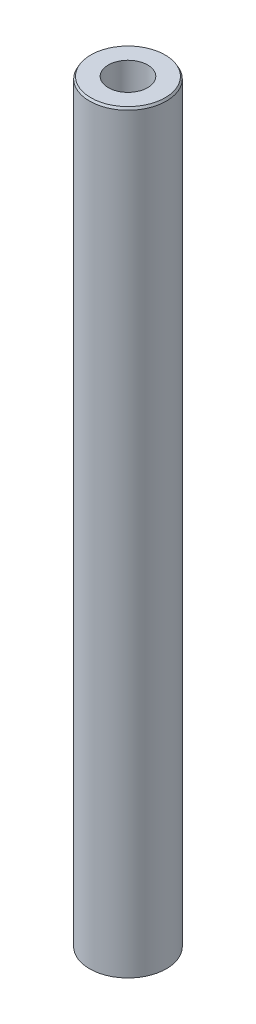
ISO-10303-21;
HEADER;
FILE_DESCRIPTION(('STEP AP214'),'2;1');
FILE_NAME('part.step','',(''),(''),'','','');
FILE_SCHEMA(('AUTOMOTIVE_DESIGN { 1 0 10303 214 1 1 1 1 }'));
ENDSEC;
DATA;
#1=APPLICATION_CONTEXT('core data for automotive mechanical design processes');
#2=APPLICATION_PROTOCOL_DEFINITION('international standard','automotive_design',2000,#1);
#3=PRODUCT_CONTEXT('',#1,'mechanical');
#4=PRODUCT('Part','Part','',(#3));
#5=PRODUCT_RELATED_PRODUCT_CATEGORY('part','',(#4));
#6=PRODUCT_DEFINITION_FORMATION('','',#4);
#7=PRODUCT_DEFINITION_CONTEXT('part definition',#1,'design');
#8=PRODUCT_DEFINITION('design','',#6,#7);
#9=PRODUCT_DEFINITION_SHAPE('','',#8);
#10=(LENGTH_UNIT() NAMED_UNIT(*) SI_UNIT(.MILLI.,.METRE.));
#11=(NAMED_UNIT(*) PLANE_ANGLE_UNIT() SI_UNIT($,.RADIAN.));
#12=(NAMED_UNIT(*) SI_UNIT($,.STERADIAN.) SOLID_ANGLE_UNIT());
#13=UNCERTAINTY_MEASURE_WITH_UNIT(LENGTH_MEASURE(1.E-05),#10,'distance_accuracy_value','');
#14=(GEOMETRIC_REPRESENTATION_CONTEXT(3) GLOBAL_UNCERTAINTY_ASSIGNED_CONTEXT((#13)) GLOBAL_UNIT_ASSIGNED_CONTEXT((#10,
#11,#12)) REPRESENTATION_CONTEXT('',''));
#15=CARTESIAN_POINT('',(0.,0.,0.));
#16=DIRECTION('',(0.,0.,1.));
#17=DIRECTION('',(1.,0.,0.));
#18=AXIS2_PLACEMENT_3D('',#15,#16,#17);
#19=CARTESIAN_POINT('',(0.,147.362707564694,0.));
#20=DIRECTION('',(0.,-1.,0.));
#21=DIRECTION('',(0.,0.,-1.));
#22=AXIS2_PLACEMENT_3D('',#19,#20,#21);
#23=CYLINDRICAL_SURFACE('',#22,7.5);
#24=CARTESIAN_POINT('',(0.,146.925996821113,0.));
#25=DIRECTION('',(0.,1.,0.));
#26=DIRECTION('',(0.,0.,1.));
#27=AXIS2_PLACEMENT_3D('',#24,#25,#26);
#28=CIRCLE('',#27,7.5);
#29=CARTESIAN_POINT('',(0.,146.925996821113,7.5));
#30=VERTEX_POINT('',#29);
#31=EDGE_CURVE('E50',#30,#30,#28,.F.);
#32=ORIENTED_EDGE('',*,*,#31,.T.);
#33=EDGE_LOOP('',(#32));
#34=FACE_BOUND('',#33,.T.);
#35=CARTESIAN_POINT('',(0.,0.252135065364645,0.));
#36=DIRECTION('',(0.,1.,0.));
#37=DIRECTION('',(0.,0.,1.));
#38=AXIS2_PLACEMENT_3D('',#35,#36,#37);
#39=CIRCLE('',#38,7.5);
#40=CARTESIAN_POINT('',(0.,0.252135065364645,7.5));
#41=VERTEX_POINT('',#40);
#42=EDGE_CURVE('E51',#41,#41,#39,.T.);
#43=ORIENTED_EDGE('',*,*,#42,.T.);
#44=EDGE_LOOP('',(#43));
#45=FACE_BOUND('',#44,.T.);
#46=ADVANCED_FACE('F39',(#34,#45),#23,.T.);
#47=CARTESIAN_POINT('',(0.,147.362707564694,0.));
#48=DIRECTION('',(0.,1.,0.));
#49=DIRECTION('',(0.,0.,1.));
#50=AXIS2_PLACEMENT_3D('',#47,#48,#49);
#51=PLANE('',#50);
#52=CARTESIAN_POINT('',(0.,147.362707564694,0.));
#53=DIRECTION('',(0.,1.,0.));
#54=DIRECTION('',(0.,0.,1.));
#55=AXIS2_PLACEMENT_3D('',#52,#53,#54);
#56=CIRCLE('',#55,7.24786493463538);
#57=CARTESIAN_POINT('',(0.,147.362707564694,7.24786493463538));
#58=VERTEX_POINT('',#57);
#59=EDGE_CURVE('E54',#58,#58,#56,.T.);
#60=ORIENTED_EDGE('',*,*,#59,.T.);
#61=EDGE_LOOP('',(#60));
#62=FACE_BOUND('',#61,.T.);
#63=CARTESIAN_POINT('',(0.,147.362707564694,0.));
#64=DIRECTION('',(0.,1.,0.));
#65=DIRECTION('',(0.,0.,1.));
#66=AXIS2_PLACEMENT_3D('',#63,#64,#65);
#67=CIRCLE('',#66,3.84632582922216);
#68=CARTESIAN_POINT('',(0.,147.362707564694,3.84632582922216));
#69=VERTEX_POINT('',#68);
#70=EDGE_CURVE('E58',#69,#69,#67,.T.);
#71=ORIENTED_EDGE('',*,*,#70,.F.);
#72=EDGE_LOOP('',(#71));
#73=FACE_BOUND('',#72,.T.);
#74=ADVANCED_FACE('F69',(#62,#73),#51,.T.);
#75=CARTESIAN_POINT('',(0.,0.,0.));
#76=DIRECTION('',(0.,1.,0.));
#77=DIRECTION('',(0.,0.,1.));
#78=AXIS2_PLACEMENT_3D('',#75,#76,#77);
#79=PLANE('',#78);
#80=CARTESIAN_POINT('',(0.,0.,0.));
#81=DIRECTION('',(0.,1.,0.));
#82=DIRECTION('',(0.,0.,1.));
#83=AXIS2_PLACEMENT_3D('',#80,#81,#82);
#84=CIRCLE('',#83,7.06328925641875);
#85=CARTESIAN_POINT('',(0.,0.,7.06328925641875));
#86=VERTEX_POINT('',#85);
#87=EDGE_CURVE('E10',#86,#86,#84,.F.);
#88=ORIENTED_EDGE('',*,*,#87,.T.);
#89=EDGE_LOOP('',(#88));
#90=FACE_BOUND('',#89,.T.);
#91=CARTESIAN_POINT('',(0.,0.,0.));
#92=DIRECTION('',(0.,1.,0.));
#93=DIRECTION('',(0.,0.,1.));
#94=AXIS2_PLACEMENT_3D('',#91,#92,#93);
#95=CIRCLE('',#94,3.84632582922216);
#96=CARTESIAN_POINT('',(0.,0.,3.84632582922216));
#97=VERTEX_POINT('',#96);
#98=EDGE_CURVE('E63',#97,#97,#95,.T.);
#99=ORIENTED_EDGE('',*,*,#98,.T.);
#100=EDGE_LOOP('',(#99));
#101=FACE_BOUND('',#100,.T.);
#102=ADVANCED_FACE('F75',(#90,#101),#79,.F.);
#103=CARTESIAN_POINT('',(0.,147.362707564694,0.));
#104=DIRECTION('',(0.,-1.,0.));
#105=DIRECTION('',(0.,0.,-1.));
#106=AXIS2_PLACEMENT_3D('',#103,#104,#105);
#107=CYLINDRICAL_SURFACE('',#106,3.84632582922216);
#108=ORIENTED_EDGE('',*,*,#70,.T.);
#109=EDGE_LOOP('',(#108));
#110=FACE_BOUND('',#109,.T.);
#111=ORIENTED_EDGE('',*,*,#98,.F.);
#112=EDGE_LOOP('',(#111));
#113=FACE_BOUND('',#112,.T.);
#114=ADVANCED_FACE('F70',(#110,#113),#107,.F.);
#115=CARTESIAN_POINT('',(0.,147.362707564694,0.));
#116=DIRECTION('',(0.,-1.,0.));
#117=DIRECTION('',(0.,0.,-1.));
#118=AXIS2_PLACEMENT_3D('',#115,#116,#117);
#119=CONICAL_SURFACE('',#118,7.24786493463538,0.523598775598269);
#120=ORIENTED_EDGE('',*,*,#31,.F.);
#121=EDGE_LOOP('',(#120));
#122=FACE_BOUND('',#121,.T.);
#123=ORIENTED_EDGE('',*,*,#59,.F.);
#124=EDGE_LOOP('',(#123));
#125=FACE_BOUND('',#124,.T.);
#126=ADVANCED_FACE('F81',(#122,#125),#119,.T.);
#127=CARTESIAN_POINT('',(0.,0.252135065364645,0.));
#128=DIRECTION('',(0.,1.,0.));
#129=DIRECTION('',(0.,0.,1.));
#130=AXIS2_PLACEMENT_3D('',#127,#128,#129);
#131=CONICAL_SURFACE('',#130,7.5,1.04719755119659);
#132=ORIENTED_EDGE('',*,*,#87,.F.);
#133=EDGE_LOOP('',(#132));
#134=FACE_BOUND('',#133,.T.);
#135=ORIENTED_EDGE('',*,*,#42,.F.);
#136=EDGE_LOOP('',(#135));
#137=FACE_BOUND('',#136,.T.);
#138=ADVANCED_FACE('F45',(#134,#137),#131,.T.);
#139=CLOSED_SHELL('',(#46,#74,#102,#114,#126,#138));
#140=MANIFOLD_SOLID_BREP('B2',#139);
#141=ADVANCED_BREP_SHAPE_REPRESENTATION('',(#18,#140),#14);
#142=SHAPE_DEFINITION_REPRESENTATION(#9,#141);
ENDSEC;
END-ISO-10303-21;
